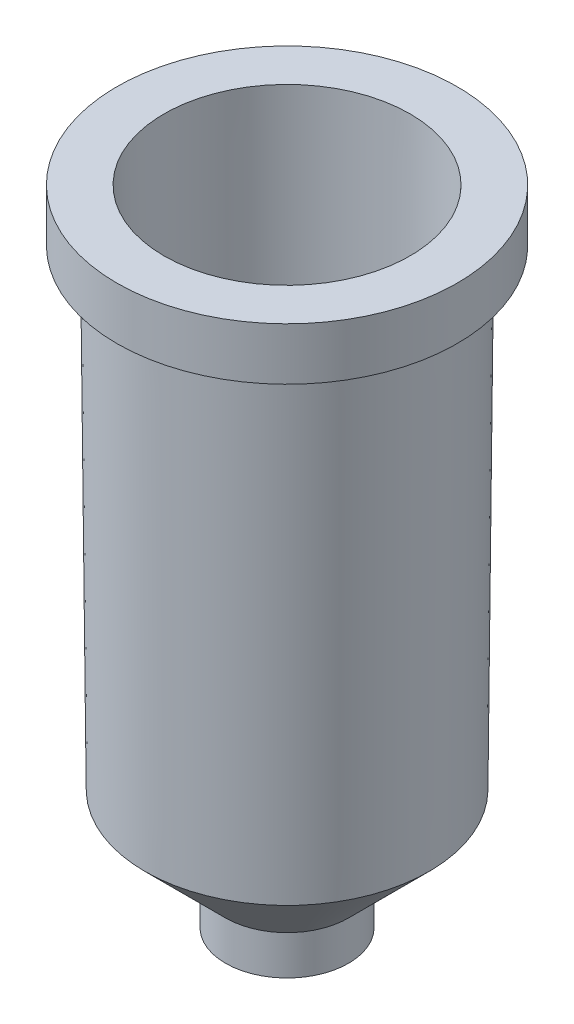
ISO-10303-21;
HEADER;
FILE_DESCRIPTION(('STEP AP214'),'2;1');
FILE_NAME('part.step','',(''),(''),'','','');
FILE_SCHEMA(('AUTOMOTIVE_DESIGN { 1 0 10303 214 1 1 1 1 }'));
ENDSEC;
DATA;
#1=APPLICATION_CONTEXT('core data for automotive mechanical design processes');
#2=APPLICATION_PROTOCOL_DEFINITION('international standard','automotive_design',2000,#1);
#3=PRODUCT_CONTEXT('',#1,'mechanical');
#4=PRODUCT('Part','Part','',(#3));
#5=PRODUCT_RELATED_PRODUCT_CATEGORY('part','',(#4));
#6=PRODUCT_DEFINITION_FORMATION('','',#4);
#7=PRODUCT_DEFINITION_CONTEXT('part definition',#1,'design');
#8=PRODUCT_DEFINITION('design','',#6,#7);
#9=PRODUCT_DEFINITION_SHAPE('','',#8);
#10=(LENGTH_UNIT() NAMED_UNIT(*) SI_UNIT(.MILLI.,.METRE.));
#11=(NAMED_UNIT(*) PLANE_ANGLE_UNIT() SI_UNIT($,.RADIAN.));
#12=(NAMED_UNIT(*) SI_UNIT($,.STERADIAN.) SOLID_ANGLE_UNIT());
#13=UNCERTAINTY_MEASURE_WITH_UNIT(LENGTH_MEASURE(1.E-05),#10,'distance_accuracy_value','');
#14=(GEOMETRIC_REPRESENTATION_CONTEXT(3) GLOBAL_UNCERTAINTY_ASSIGNED_CONTEXT((#13)) GLOBAL_UNIT_ASSIGNED_CONTEXT((#10,
#11,#12)) REPRESENTATION_CONTEXT('',''));
#15=CARTESIAN_POINT('',(0.,0.,0.));
#16=DIRECTION('',(0.,0.,1.));
#17=DIRECTION('',(1.,0.,0.));
#18=AXIS2_PLACEMENT_3D('',#15,#16,#17);
#19=CARTESIAN_POINT('',(0.,-1.53301265872674,0.));
#20=DIRECTION('',(0.,1.,0.));
#21=DIRECTION('',(0.,0.,1.));
#22=AXIS2_PLACEMENT_3D('',#19,#20,#21);
#23=CONICAL_SURFACE('',#22,4.02379446640316,0.00872664625997156);
#24=CARTESIAN_POINT('',(0.,-18.3336048573579,0.));
#25=DIRECTION('',(0.,1.,0.));
#26=DIRECTION('',(0.,0.,1.));
#27=AXIS2_PLACEMENT_3D('',#24,#25,#26);
#28=CIRCLE('',#27,3.87717791947926);
#29=CARTESIAN_POINT('',(0.,-18.3336048573579,3.87717791947925));
#30=VERTEX_POINT('',#29);
#31=EDGE_CURVE('E103',#30,#30,#28,.T.);
#32=ORIENTED_EDGE('',*,*,#31,.F.);
#33=EDGE_LOOP('',(#32));
#34=FACE_BOUND('',#33,.T.);
#35=CARTESIAN_POINT('',(0.,-1.53301265872674,0.));
#36=DIRECTION('',(0.,1.,0.));
#37=DIRECTION('',(0.,0.,1.));
#38=AXIS2_PLACEMENT_3D('',#35,#36,#37);
#39=CIRCLE('',#38,4.02379446640316);
#40=CARTESIAN_POINT('',(0.,-1.53301265872674,4.02379446640316));
#41=VERTEX_POINT('',#40);
#42=EDGE_CURVE('E67',#41,#41,#39,.T.);
#43=ORIENTED_EDGE('',*,*,#42,.T.);
#44=EDGE_LOOP('',(#43));
#45=FACE_BOUND('',#44,.T.);
#46=ADVANCED_FACE('F42',(#34,#45),#23,.F.);
#47=CARTESIAN_POINT('',(0.,-1.53301265872674,0.));
#48=DIRECTION('',(0.,1.,0.));
#49=DIRECTION('',(0.,0.,1.));
#50=AXIS2_PLACEMENT_3D('',#47,#48,#49);
#51=PLANE('',#50);
#52=CARTESIAN_POINT('',(0.,-1.53301265872674,0.));
#53=DIRECTION('',(0.,1.,0.));
#54=DIRECTION('',(0.,0.,1.));
#55=AXIS2_PLACEMENT_3D('',#52,#53,#54);
#56=CIRCLE('',#55,5.56482213438735);
#57=CARTESIAN_POINT('',(0.,-1.53301265872674,5.56482213438735));
#58=VERTEX_POINT('',#57);
#59=EDGE_CURVE('E71',#58,#58,#56,.T.);
#60=ORIENTED_EDGE('',*,*,#59,.T.);
#61=EDGE_LOOP('',(#60));
#62=FACE_BOUND('',#61,.T.);
#63=ORIENTED_EDGE('',*,*,#42,.F.);
#64=EDGE_LOOP('',(#63));
#65=FACE_BOUND('',#64,.T.);
#66=ADVANCED_FACE('F112',(#62,#65),#51,.T.);
#67=CARTESIAN_POINT('',(0.,-1.53301265872674,0.));
#68=DIRECTION('',(0.,1.,0.));
#69=DIRECTION('',(0.,0.,1.));
#70=AXIS2_PLACEMENT_3D('',#67,#68,#69);
#71=CYLINDRICAL_SURFACE('',#70,5.56482213438735);
#72=CARTESIAN_POINT('',(0.,-3.24526562315362,0.));
#73=DIRECTION('',(0.,1.,0.));
#74=DIRECTION('',(0.,0.,1.));
#75=AXIS2_PLACEMENT_3D('',#72,#73,#74);
#76=CIRCLE('',#75,5.56482213438735);
#77=CARTESIAN_POINT('',(0.,-3.24526562315362,5.56482213438735));
#78=VERTEX_POINT('',#77);
#79=EDGE_CURVE('E75',#78,#78,#76,.T.);
#80=ORIENTED_EDGE('',*,*,#79,.T.);
#81=EDGE_LOOP('',(#80));
#82=FACE_BOUND('',#81,.T.);
#83=ORIENTED_EDGE('',*,*,#59,.F.);
#84=EDGE_LOOP('',(#83));
#85=FACE_BOUND('',#84,.T.);
#86=ADVANCED_FACE('F117',(#82,#85),#71,.T.);
#87=CARTESIAN_POINT('',(0.,-3.24526562315362,0.));
#88=DIRECTION('',(0.,-1.,0.));
#89=DIRECTION('',(0.,0.,-1.));
#90=AXIS2_PLACEMENT_3D('',#87,#88,#89);
#91=PLANE('',#90);
#92=CARTESIAN_POINT('',(0.,-3.24526562315362,0.));
#93=DIRECTION('',(0.,1.,0.));
#94=DIRECTION('',(0.,0.,1.));
#95=AXIS2_PLACEMENT_3D('',#92,#93,#94);
#96=CIRCLE('',#95,4.77939503507335);
#97=CARTESIAN_POINT('',(0.,-3.24526562315362,4.77939503507335));
#98=VERTEX_POINT('',#97);
#99=EDGE_CURVE('E79',#98,#98,#96,.T.);
#100=ORIENTED_EDGE('',*,*,#99,.T.);
#101=EDGE_LOOP('',(#100));
#102=FACE_BOUND('',#101,.T.);
#103=ORIENTED_EDGE('',*,*,#79,.F.);
#104=EDGE_LOOP('',(#103));
#105=FACE_BOUND('',#104,.T.);
#106=ADVANCED_FACE('F123',(#102,#105),#91,.T.);
#107=CARTESIAN_POINT('',(0.,-18.6555423029955,0.));
#108=DIRECTION('',(0.,1.,0.));
#109=DIRECTION('',(0.,0.,1.));
#110=AXIS2_PLACEMENT_3D('',#107,#108,#109);
#111=CONICAL_SURFACE('',#110,4.64491158786936,0.00872664625997156);
#112=ORIENTED_EDGE('',*,*,#99,.F.);
#113=EDGE_LOOP('',(#112));
#114=FACE_BOUND('',#113,.T.);
#115=CARTESIAN_POINT('',(0.,-18.6555423029955,0.));
#116=DIRECTION('',(0.,1.,0.));
#117=DIRECTION('',(0.,0.,1.));
#118=AXIS2_PLACEMENT_3D('',#115,#116,#117);
#119=CIRCLE('',#118,4.64491158786936);
#120=CARTESIAN_POINT('',(0.,-18.6555423029955,4.64491158786936));
#121=VERTEX_POINT('',#120);
#122=EDGE_CURVE('E83',#121,#121,#119,.T.);
#123=ORIENTED_EDGE('',*,*,#122,.T.);
#124=EDGE_LOOP('',(#123));
#125=FACE_BOUND('',#124,.T.);
#126=ADVANCED_FACE('F185',(#114,#125),#111,.T.);
#127=CARTESIAN_POINT('',(0.,-18.6555423029955,0.));
#128=DIRECTION('',(0.,1.,0.));
#129=DIRECTION('',(0.,0.,1.));
#130=AXIS2_PLACEMENT_3D('',#127,#128,#129);
#131=CONICAL_SURFACE('',#130,4.64491158786936,0.78539816339745);
#132=CARTESIAN_POINT('',(0.,-21.2885566576633,0.));
#133=DIRECTION('',(0.,1.,0.));
#134=DIRECTION('',(0.,0.,1.));
#135=AXIS2_PLACEMENT_3D('',#132,#133,#134);
#136=CIRCLE('',#135,2.01189723320158);
#137=CARTESIAN_POINT('',(0.,-21.2885566576633,2.01189723320158));
#138=VERTEX_POINT('',#137);
#139=EDGE_CURVE('E87',#138,#138,#136,.T.);
#140=ORIENTED_EDGE('',*,*,#139,.T.);
#141=EDGE_LOOP('',(#140));
#142=FACE_BOUND('',#141,.T.);
#143=ORIENTED_EDGE('',*,*,#122,.F.);
#144=EDGE_LOOP('',(#143));
#145=FACE_BOUND('',#144,.T.);
#146=ADVANCED_FACE('F177',(#142,#145),#131,.T.);
#147=CARTESIAN_POINT('',(0.,-1.53301265872674,0.));
#148=DIRECTION('',(0.,1.,0.));
#149=DIRECTION('',(0.,0.,1.));
#150=AXIS2_PLACEMENT_3D('',#147,#148,#149);
#151=CYLINDRICAL_SURFACE('',#150,2.01189723320158);
#152=ORIENTED_EDGE('',*,*,#139,.F.);
#153=EDGE_LOOP('',(#152));
#154=FACE_BOUND('',#153,.T.);
#155=CARTESIAN_POINT('',(0.,-22.5727463809834,0.));
#156=DIRECTION('',(0.,1.,0.));
#157=DIRECTION('',(0.,0.,1.));
#158=AXIS2_PLACEMENT_3D('',#155,#156,#157);
#159=CIRCLE('',#158,2.01189723320158);
#160=CARTESIAN_POINT('',(0.,-22.5727463809834,2.01189723320158));
#161=VERTEX_POINT('',#160);
#162=EDGE_CURVE('E91',#161,#161,#159,.T.);
#163=ORIENTED_EDGE('',*,*,#162,.T.);
#164=EDGE_LOOP('',(#163));
#165=FACE_BOUND('',#164,.T.);
#166=ADVANCED_FACE('F169',(#154,#165),#151,.T.);
#167=CARTESIAN_POINT('',(0.,-22.5727463809834,0.));
#168=DIRECTION('',(0.,-1.,0.));
#169=DIRECTION('',(0.,0.,-1.));
#170=AXIS2_PLACEMENT_3D('',#167,#168,#169);
#171=PLANE('',#170);
#172=CARTESIAN_POINT('',(0.,-22.5727463809834,0.));
#173=DIRECTION('',(0.,1.,0.));
#174=DIRECTION('',(0.,0.,1.));
#175=AXIS2_PLACEMENT_3D('',#172,#173,#174);
#176=CIRCLE('',#175,1.24138339920949);
#177=CARTESIAN_POINT('',(0.,-22.5727463809834,1.24138339920949));
#178=VERTEX_POINT('',#177);
#179=EDGE_CURVE('E95',#178,#178,#176,.T.);
#180=ORIENTED_EDGE('',*,*,#179,.T.);
#181=EDGE_LOOP('',(#180));
#182=FACE_BOUND('',#181,.T.);
#183=ORIENTED_EDGE('',*,*,#162,.F.);
#184=EDGE_LOOP('',(#183));
#185=FACE_BOUND('',#184,.T.);
#186=ADVANCED_FACE('F161',(#182,#185),#171,.T.);
#187=CARTESIAN_POINT('',(0.,-1.53301265872674,0.));
#188=DIRECTION('',(0.,1.,0.));
#189=DIRECTION('',(0.,0.,1.));
#190=AXIS2_PLACEMENT_3D('',#187,#188,#189);
#191=CYLINDRICAL_SURFACE('',#190,1.24138339920949);
#192=CARTESIAN_POINT('',(0.,-20.9693993776277,0.));
#193=DIRECTION('',(0.,1.,0.));
#194=DIRECTION('',(0.,0.,1.));
#195=AXIS2_PLACEMENT_3D('',#192,#193,#194);
#196=CIRCLE('',#195,1.24138339920949);
#197=CARTESIAN_POINT('',(0.,-20.9693993776277,1.24138339920948));
#198=VERTEX_POINT('',#197);
#199=EDGE_CURVE('E99',#198,#198,#196,.T.);
#200=ORIENTED_EDGE('',*,*,#199,.T.);
#201=EDGE_LOOP('',(#200));
#202=FACE_BOUND('',#201,.T.);
#203=ORIENTED_EDGE('',*,*,#179,.F.);
#204=EDGE_LOOP('',(#203));
#205=FACE_BOUND('',#204,.T.);
#206=ADVANCED_FACE('F153',(#202,#205),#191,.F.);
#207=CARTESIAN_POINT('',(0.,-18.3336048573579,0.));
#208=DIRECTION('',(0.,1.,0.));
#209=DIRECTION('',(0.,0.,1.));
#210=AXIS2_PLACEMENT_3D('',#207,#208,#209);
#211=CONICAL_SURFACE('',#210,3.87717791947926,0.78539816339745);
#212=CARTESIAN_POINT('',(0.,-20.9693993776277,1.24138339920948));
#213=CARTESIAN_POINT('',(0.,-20.9419431847082,1.26883959212896));
#214=CARTESIAN_POINT('',(0.,-20.9144869917887,1.29629578504844));
#215=CARTESIAN_POINT('',(0.,-20.8595746059498,1.35120817088739));
#216=CARTESIAN_POINT('',(0.,-20.8321184130303,1.37866436380687));
#217=CARTESIAN_POINT('',(0.,-20.7772060271913,1.43357674964582));
#218=CARTESIAN_POINT('',(0.,-20.7497498342719,1.4610329425653));
#219=CARTESIAN_POINT('',(0.,-20.6948374484329,1.51594532840425));
#220=CARTESIAN_POINT('',(0.,-20.6673812555134,1.54340152132373));
#221=CARTESIAN_POINT('',(0.,-20.6124688696745,1.59831390716268));
#222=CARTESIAN_POINT('',(0.,-20.585012676755,1.62577010008216));
#223=CARTESIAN_POINT('',(0.,-20.530100290916,1.68068248592111));
#224=CARTESIAN_POINT('',(0.,-20.5026440979966,1.70813867884059));
#225=CARTESIAN_POINT('',(0.,-20.4477317121576,1.76305106467954));
#226=CARTESIAN_POINT('',(0.,-20.4202755192381,1.79050725759902));
#227=CARTESIAN_POINT('',(0.,-20.3653631333992,1.84541964343797));
#228=CARTESIAN_POINT('',(0.,-20.3379069404797,1.87287583635745));
#229=CARTESIAN_POINT('',(0.,-20.2829945546408,1.9277882221964));
#230=CARTESIAN_POINT('',(0.,-20.2555383617213,1.95524441511588));
#231=CARTESIAN_POINT('',(0.,-20.2006259758823,2.01015680095483));
#232=CARTESIAN_POINT('',(0.,-20.1731697829628,2.03761299387431));
#233=CARTESIAN_POINT('',(0.,-20.1182573971239,2.09252537971326));
#234=CARTESIAN_POINT('',(0.,-20.0908012042044,2.11998157263274));
#235=CARTESIAN_POINT('',(0.,-20.0358888183655,2.17489395847169));
#236=CARTESIAN_POINT('',(0.,-20.008432625446,2.20235015139117));
#237=CARTESIAN_POINT('',(0.,-19.953520239607,2.25726253723012));
#238=CARTESIAN_POINT('',(0.,-19.9260640466876,2.2847187301496));
#239=CARTESIAN_POINT('',(0.,-19.8711516608486,2.33963111598855));
#240=CARTESIAN_POINT('',(0.,-19.8436954679291,2.36708730890803));
#241=CARTESIAN_POINT('',(0.,-19.7887830820902,2.42199969474698));
#242=CARTESIAN_POINT('',(0.,-19.7613268891707,2.44945588766646));
#243=CARTESIAN_POINT('',(0.,-19.7064145033317,2.50436827350541));
#244=CARTESIAN_POINT('',(0.,-19.6789583104123,2.53182446642489));
#245=CARTESIAN_POINT('',(0.,-19.6240459245733,2.58673685226384));
#246=CARTESIAN_POINT('',(0.,-19.5965897316538,2.61419304518332));
#247=CARTESIAN_POINT('',(0.,-19.5416773458149,2.66910543102227));
#248=CARTESIAN_POINT('',(0.,-19.5142211528954,2.69656162394175));
#249=CARTESIAN_POINT('',(0.,-19.4593087670565,2.75147400978071));
#250=CARTESIAN_POINT('',(0.,-19.431852574137,2.77893020270018));
#251=CARTESIAN_POINT('',(0.,-19.376940188298,2.83384258853914));
#252=CARTESIAN_POINT('',(0.,-19.3494839953785,2.86129878145861));
#253=CARTESIAN_POINT('',(0.,-19.2945716095396,2.91621116729757));
#254=CARTESIAN_POINT('',(0.,-19.2671154166201,2.94366736021704));
#255=CARTESIAN_POINT('',(0.,-19.2122030307812,2.998579746056));
#256=CARTESIAN_POINT('',(0.,-19.1847468378617,3.02603593897547));
#257=CARTESIAN_POINT('',(0.,-19.1298344520227,3.08094832481443));
#258=CARTESIAN_POINT('',(0.,-19.1023782591033,3.1084045177339));
#259=CARTESIAN_POINT('',(0.,-19.0474658732643,3.16331690357286));
#260=CARTESIAN_POINT('',(0.,-19.0200096803448,3.19077309649233));
#261=CARTESIAN_POINT('',(0.,-18.9650972945059,3.24568548233129));
#262=CARTESIAN_POINT('',(0.,-18.9376411015864,3.27314167525076));
#263=CARTESIAN_POINT('',(0.,-18.8827287157474,3.32805406108972));
#264=CARTESIAN_POINT('',(0.,-18.855272522828,3.3555102540092));
#265=CARTESIAN_POINT('',(0.,-18.800360136989,3.41042263984815));
#266=CARTESIAN_POINT('',(0.,-18.7729039440695,3.43787883276763));
#267=CARTESIAN_POINT('',(0.,-18.7179915582306,3.49279121860658));
#268=CARTESIAN_POINT('',(0.,-18.6905353653111,3.52024741152606));
#269=CARTESIAN_POINT('',(0.,-18.6356229794721,3.57515979736501));
#270=CARTESIAN_POINT('',(0.,-18.6081667865527,3.60261599028449));
#271=CARTESIAN_POINT('',(0.,-18.5532544007137,3.65752837612344));
#272=CARTESIAN_POINT('',(0.,-18.5257982077942,3.68498456904292));
#273=CARTESIAN_POINT('',(0.,-18.4708858219553,3.73989695488187));
#274=CARTESIAN_POINT('',(0.,-18.4434296290358,3.76735314780135));
#275=CARTESIAN_POINT('',(0.,-18.3885172431969,3.8222655336403));
#276=CARTESIAN_POINT('',(0.,-18.3610610502774,3.84972172655978));
#277=CARTESIAN_POINT('',(0.,-18.3336048573579,3.87717791947925));
#278=B_SPLINE_CURVE_WITH_KNOTS('',3,(#212,#213,#214,#215,#216,#217,#218,#219,#220,#221,#222,
#223,#224,#225,#226,#227,#228,#229,#230,#231,#232,#233,#234,#235,#236,#237,#238,#239,#240,#241,
#242,#243,#244,#245,#246,#247,#248,#249,#250,#251,#252,#253,#254,#255,#256,#257,#258,#259,#260,
#261,#262,#263,#264,#265,#266,#267,#268,#269,#270,#271,#272,#273,#274,#275,#276,#277),
.UNSPECIFIED.,.F.,.F.,(4,2,2,2,2,2,2,2,2,2,2,2,2,2,2,2,2,2,2,2,2,2,2,2,2,2,2,2,2,2,2,2,4),(0.,
0.116486761193571,0.232973522387139,0.349460283580706,0.465947044774274,0.582433805967845,
0.698920567161413,0.81540732835498,0.931894089548549,1.04838085074212,1.16486761193568,
1.28135437312926,1.39784113432282,1.51432789551639,1.63081465670996,1.74730141790353,
1.8637881790971,1.98027494029066,2.09676170148423,2.2132484626778,2.32973522387137,
2.44622198506494,2.56270874625851,2.67919550745208,2.79568226864564,2.91216902983921,
3.02865579103278,3.14514255222635,3.26162931341992,3.37811607461349,3.49460283580705,
3.61108959700062,3.72757635819419),.UNSPECIFIED.);
#279=EDGE_CURVE('BSEAM108',#198,#30,#278,.T.);
#280=ORIENTED_EDGE('',*,*,#199,.F.);
#281=ORIENTED_EDGE('',*,*,#31,.T.);
#282=ORIENTED_EDGE('',*,*,#279,.T.);
#283=ORIENTED_EDGE('',*,*,#279,.F.);
#284=EDGE_LOOP('',(#280,#282,#281,#283));
#285=FACE_BOUND('',#284,.T.);
#286=ADVANCED_FACE('F108',(#285),#211,.F.);
#287=CLOSED_SHELL('',(#46,#66,#86,#106,#126,#146,#166,#186,#206,#286));
#288=CARTESIAN_POINT('',(0.,-2.47475178916153,0.));
#289=DIRECTION('',(0.,1.,0.));
#290=DIRECTION('',(0.,0.,1.));
#291=AXIS2_PLACEMENT_3D('',#288,#289,#290);
#292=CONICAL_SURFACE('',#291,4.78611920743356,0.00872664625997019);
#293=CARTESIAN_POINT('',(0.,-2.30352649271884,0.));
#294=DIRECTION('',(0.,1.,0.));
#295=DIRECTION('',(0.,0.,1.));
#296=AXIS2_PLACEMENT_3D('',#293,#294,#295);
#297=CIRCLE('',#296,4.78761346795804);
#298=CARTESIAN_POINT('',(0.,-2.30352649271884,4.78761346795804));
#299=VERTEX_POINT('',#298);
#300=EDGE_CURVE('E61',#299,#299,#297,.T.);
#301=ORIENTED_EDGE('',*,*,#300,.F.);
#302=EDGE_LOOP('',(#301));
#303=FACE_BOUND('',#302,.T.);
#304=CARTESIAN_POINT('',(0.,-2.47475178916153,0.));
#305=DIRECTION('',(0.,1.,0.));
#306=DIRECTION('',(0.,0.,1.));
#307=AXIS2_PLACEMENT_3D('',#304,#305,#306);
#308=CIRCLE('',#307,4.78611920743356);
#309=CARTESIAN_POINT('',(0.,-2.47475178916153,4.78611920743356));
#310=VERTEX_POINT('',#309);
#311=EDGE_CURVE('E10',#310,#310,#308,.T.);
#312=ORIENTED_EDGE('',*,*,#311,.T.);
#313=EDGE_LOOP('',(#312));
#314=FACE_BOUND('',#313,.T.);
#315=ADVANCED_FACE('F44',(#303,#314),#292,.T.);
#316=CARTESIAN_POINT('',(0.,-2.47475178916153,0.));
#317=DIRECTION('',(0.,-1.,0.));
#318=DIRECTION('',(0.,0.,-1.));
#319=AXIS2_PLACEMENT_3D('',#316,#317,#318);
#320=PLANE('',#319);
#321=ORIENTED_EDGE('',*,*,#311,.F.);
#322=EDGE_LOOP('',(#321));
#323=FACE_BOUND('',#322,.T.);
#324=CARTESIAN_POINT('',(0.,-2.47475178916153,0.));
#325=DIRECTION('',(0.,1.,0.));
#326=DIRECTION('',(0.,0.,1.));
#327=AXIS2_PLACEMENT_3D('',#324,#325,#326);
#328=CIRCLE('',#327,4.79430830039526);
#329=CARTESIAN_POINT('',(0.,-2.47475178916153,4.79430830039526));
#330=VERTEX_POINT('',#329);
#331=EDGE_CURVE('E51',#330,#330,#328,.T.);
#332=ORIENTED_EDGE('',*,*,#331,.T.);
#333=EDGE_LOOP('',(#332));
#334=FACE_BOUND('',#333,.T.);
#335=ADVANCED_FACE('F135',(#323,#334),#320,.F.);
#336=CARTESIAN_POINT('',(0.,-1.53301265872674,0.));
#337=DIRECTION('',(0.,1.,0.));
#338=DIRECTION('',(0.,0.,1.));
#339=AXIS2_PLACEMENT_3D('',#336,#337,#338);
#340=CYLINDRICAL_SURFACE('',#339,4.79430830039526);
#341=ORIENTED_EDGE('',*,*,#331,.F.);
#342=EDGE_LOOP('',(#341));
#343=FACE_BOUND('',#342,.T.);
#344=CARTESIAN_POINT('',(0.,-2.30352649271884,0.));
#345=DIRECTION('',(0.,1.,0.));
#346=DIRECTION('',(0.,0.,1.));
#347=AXIS2_PLACEMENT_3D('',#344,#345,#346);
#348=CIRCLE('',#347,4.79430830039526);
#349=CARTESIAN_POINT('',(0.,-2.30352649271884,4.79430830039526));
#350=VERTEX_POINT('',#349);
#351=EDGE_CURVE('E56',#350,#350,#348,.T.);
#352=ORIENTED_EDGE('',*,*,#351,.T.);
#353=EDGE_LOOP('',(#352));
#354=FACE_BOUND('',#353,.T.);
#355=ADVANCED_FACE('F131',(#343,#354),#340,.F.);
#356=CARTESIAN_POINT('',(0.,-2.30352649271884,0.));
#357=DIRECTION('',(0.,1.,0.));
#358=DIRECTION('',(0.,0.,1.));
#359=AXIS2_PLACEMENT_3D('',#356,#357,#358);
#360=PLANE('',#359);
#361=ORIENTED_EDGE('',*,*,#351,.F.);
#362=EDGE_LOOP('',(#361));
#363=FACE_BOUND('',#362,.T.);
#364=ORIENTED_EDGE('',*,*,#300,.T.);
#365=EDGE_LOOP('',(#364));
#366=FACE_BOUND('',#365,.T.);
#367=ADVANCED_FACE('F128',(#363,#366),#360,.F.);
#368=CLOSED_SHELL('',(#315,#335,#355,#367));
#369=ORIENTED_CLOSED_SHELL('',*,#368,.T.);
#370=BREP_WITH_VOIDS('B2',#287,(#369));
#371=ADVANCED_BREP_SHAPE_REPRESENTATION('',(#18,#370),#14);
#372=SHAPE_DEFINITION_REPRESENTATION(#9,#371);
ENDSEC;
END-ISO-10303-21;
